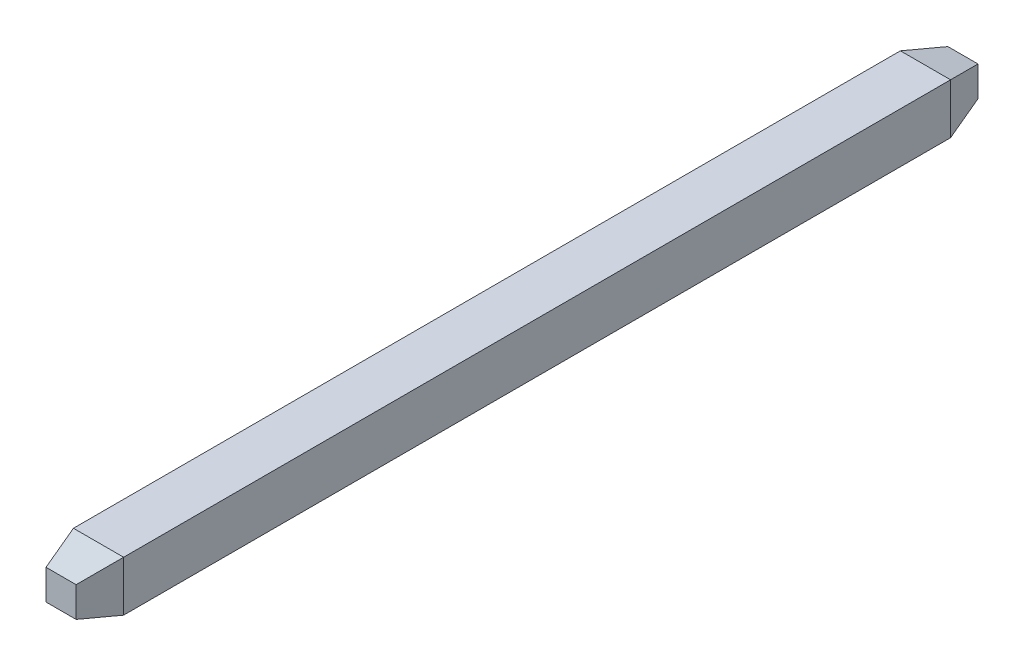
ISO-10303-21;
HEADER;
FILE_DESCRIPTION(('STEP AP214'),'2;1');
FILE_NAME('part.step','',(''),(''),'','','');
FILE_SCHEMA(('AUTOMOTIVE_DESIGN { 1 0 10303 214 1 1 1 1 }'));
ENDSEC;
DATA;
#1=APPLICATION_CONTEXT('core data for automotive mechanical design processes');
#2=APPLICATION_PROTOCOL_DEFINITION('international standard','automotive_design',2000,#1);
#3=PRODUCT_CONTEXT('',#1,'mechanical');
#4=PRODUCT('Part','Part','',(#3));
#5=PRODUCT_RELATED_PRODUCT_CATEGORY('part','',(#4));
#6=PRODUCT_DEFINITION_FORMATION('','',#4);
#7=PRODUCT_DEFINITION_CONTEXT('part definition',#1,'design');
#8=PRODUCT_DEFINITION('design','',#6,#7);
#9=PRODUCT_DEFINITION_SHAPE('','',#8);
#10=(LENGTH_UNIT() NAMED_UNIT(*) SI_UNIT(.MILLI.,.METRE.));
#11=(NAMED_UNIT(*) PLANE_ANGLE_UNIT() SI_UNIT($,.RADIAN.));
#12=(NAMED_UNIT(*) SI_UNIT($,.STERADIAN.) SOLID_ANGLE_UNIT());
#13=UNCERTAINTY_MEASURE_WITH_UNIT(LENGTH_MEASURE(1.E-05),#10,'distance_accuracy_value','');
#14=(GEOMETRIC_REPRESENTATION_CONTEXT(3) GLOBAL_UNCERTAINTY_ASSIGNED_CONTEXT((#13)) GLOBAL_UNIT_ASSIGNED_CONTEXT((#10,
#11,#12)) REPRESENTATION_CONTEXT('',''));
#15=CARTESIAN_POINT('',(0.,0.,0.));
#16=DIRECTION('',(0.,0.,1.));
#17=DIRECTION('',(1.,0.,0.));
#18=AXIS2_PLACEMENT_3D('',#15,#16,#17);
#19=CARTESIAN_POINT('',(2.86,-1.53140500673767,7.92229749663118));
#20=DIRECTION('',(0.965925826289069,0.,0.25881904510252));
#21=DIRECTION('',(0.25881904510252,0.,-0.965925826289069));
#22=AXIS2_PLACEMENT_3D('',#19,#20,#21);
#23=PLANE('',#22);
#24=DIRECTION('',(0.,1.,0.));
#25=VECTOR('',#24,1.);
#26=CARTESIAN_POINT('',(2.732,0.,8.4));
#27=LINE('',#26,#25);
#28=CARTESIAN_POINT('',(2.732,-0.192000000000036,8.4));
#29=VERTEX_POINT('',#28);
#30=CARTESIAN_POINT('',(2.732,0.191999999999964,8.4));
#31=VERTEX_POINT('',#30);
#32=EDGE_CURVE('E20',#29,#31,#27,.T.);
#33=ORIENTED_EDGE('',*,*,#32,.F.);
#34=DIRECTION('',(-0.25056280708573,0.250562807085731,0.93511312653103));
#35=VECTOR('',#34,1.);
#36=CARTESIAN_POINT('',(2.86,-0.320000000000036,7.92229749663118));
#37=LINE('',#36,#35);
#38=CARTESIAN_POINT('',(2.86,-0.320000000000036,7.92229749663118));
#39=VERTEX_POINT('',#38);
#40=EDGE_CURVE('E110',#39,#29,#37,.T.);
#41=ORIENTED_EDGE('',*,*,#40,.F.);
#42=DIRECTION('',(0.,1.,0.));
#43=VECTOR('',#42,1.);
#44=CARTESIAN_POINT('',(2.86,-0.320000000000036,7.92229749663118));
#45=LINE('',#44,#43);
#46=CARTESIAN_POINT('',(2.86,0.319999999999963,7.92229749663118));
#47=VERTEX_POINT('',#46);
#48=EDGE_CURVE('E96',#47,#39,#45,.F.);
#49=ORIENTED_EDGE('',*,*,#48,.F.);
#50=DIRECTION('',(0.25056280708573,0.250562807085731,-0.93511312653103));
#51=VECTOR('',#50,1.);
#52=CARTESIAN_POINT('',(2.732,0.191999999999963,8.4));
#53=LINE('',#52,#51);
#54=EDGE_CURVE('E94',#31,#47,#53,.T.);
#55=ORIENTED_EDGE('',*,*,#54,.F.);
#56=EDGE_LOOP('',(#33,#41,#49,#55));
#57=FACE_BOUND('',#56,.T.);
#58=ADVANCED_FACE('F17',(#57),#23,.T.);
#59=CARTESIAN_POINT('',(2.86,-1.53140500673767,-2.62229749663118));
#60=DIRECTION('',(-0.965925826289068,0.,0.258819045102521));
#61=DIRECTION('',(0.258819045102521,0.,0.965925826289068));
#62=AXIS2_PLACEMENT_3D('',#59,#60,#61);
#63=PLANE('',#62);
#64=DIRECTION('',(-0.25056280708573,0.250562807085732,-0.93511312653103));
#65=VECTOR('',#64,1.);
#66=CARTESIAN_POINT('',(2.86,-0.320000000000036,-2.62229749663118));
#67=LINE('',#66,#65);
#68=CARTESIAN_POINT('',(2.86,-0.320000000000036,-2.62229749663118));
#69=VERTEX_POINT('',#68);
#70=CARTESIAN_POINT('',(2.732,-0.192000000000036,-3.1));
#71=VERTEX_POINT('',#70);
#72=EDGE_CURVE('E113',#69,#71,#67,.T.);
#73=ORIENTED_EDGE('',*,*,#72,.T.);
#74=DIRECTION('',(0.,1.,0.));
#75=VECTOR('',#74,1.);
#76=CARTESIAN_POINT('',(2.732,0.,-3.1));
#77=LINE('',#76,#75);
#78=CARTESIAN_POINT('',(2.732,0.191999999999964,-3.1));
#79=VERTEX_POINT('',#78);
#80=EDGE_CURVE('E79',#71,#79,#77,.T.);
#81=ORIENTED_EDGE('',*,*,#80,.T.);
#82=DIRECTION('',(0.25056280708573,0.250562807085732,0.93511312653103));
#83=VECTOR('',#82,1.);
#84=CARTESIAN_POINT('',(2.732,0.191999999999962,-3.1));
#85=LINE('',#84,#83);
#86=CARTESIAN_POINT('',(2.86,0.319999999999963,-2.62229749663118));
#87=VERTEX_POINT('',#86);
#88=EDGE_CURVE('E108',#79,#87,#85,.T.);
#89=ORIENTED_EDGE('',*,*,#88,.T.);
#90=DIRECTION('',(0.,1.,0.));
#91=VECTOR('',#90,1.);
#92=CARTESIAN_POINT('',(2.86,-0.320000000000036,-2.62229749663118));
#93=LINE('',#92,#91);
#94=EDGE_CURVE('E118',#69,#87,#93,.T.);
#95=ORIENTED_EDGE('',*,*,#94,.F.);
#96=EDGE_LOOP('',(#73,#81,#89,#95));
#97=FACE_BOUND('',#96,.T.);
#98=ADVANCED_FACE('F281',(#97),#63,.F.);
#99=CARTESIAN_POINT('',(2.54,0.,8.4));
#100=DIRECTION('',(0.,0.,1.));
#101=DIRECTION('',(1.,0.,0.));
#102=AXIS2_PLACEMENT_3D('',#99,#100,#101);
#103=PLANE('',#102);
#104=DIRECTION('',(1.,0.,0.));
#105=VECTOR('',#104,1.);
#106=CARTESIAN_POINT('',(1.00859499326237,-0.192000000000036,8.4));
#107=LINE('',#106,#105);
#108=CARTESIAN_POINT('',(2.348,-0.192000000000036,8.4));
#109=VERTEX_POINT('',#108);
#110=EDGE_CURVE('E90',#29,#109,#107,.F.);
#111=ORIENTED_EDGE('',*,*,#110,.F.);
#112=ORIENTED_EDGE('',*,*,#32,.T.);
#113=DIRECTION('',(1.,0.,0.));
#114=VECTOR('',#113,1.);
#115=CARTESIAN_POINT('',(4.07140500673763,0.191999999999962,8.4));
#116=LINE('',#115,#114);
#117=CARTESIAN_POINT('',(2.348,0.191999999999963,8.4));
#118=VERTEX_POINT('',#117);
#119=EDGE_CURVE('E88',#118,#31,#116,.T.);
#120=ORIENTED_EDGE('',*,*,#119,.F.);
#121=DIRECTION('',(0.,1.,0.));
#122=VECTOR('',#121,1.);
#123=CARTESIAN_POINT('',(2.348,1.53140500673759,8.4));
#124=LINE('',#123,#122);
#125=EDGE_CURVE('E124',#109,#118,#124,.T.);
#126=ORIENTED_EDGE('',*,*,#125,.F.);
#127=EDGE_LOOP('',(#111,#112,#120,#126));
#128=FACE_BOUND('',#127,.T.);
#129=ADVANCED_FACE('F85',(#128),#103,.T.);
#130=CARTESIAN_POINT('',(4.07140500673763,0.319999999999963,7.92229749663118));
#131=DIRECTION('',(0.,0.965925826289069,0.25881904510252));
#132=DIRECTION('',(0.,-0.25881904510252,0.965925826289069));
#133=AXIS2_PLACEMENT_3D('',#130,#131,#132);
#134=PLANE('',#133);
#135=ORIENTED_EDGE('',*,*,#119,.T.);
#136=ORIENTED_EDGE('',*,*,#54,.T.);
#137=DIRECTION('',(-1.,0.,0.));
#138=VECTOR('',#137,1.);
#139=CARTESIAN_POINT('',(2.86,0.319999999999963,7.92229749663118));
#140=LINE('',#139,#138);
#141=CARTESIAN_POINT('',(2.22,0.319999999999963,7.92229749663118));
#142=VERTEX_POINT('',#141);
#143=EDGE_CURVE('E127',#142,#47,#140,.F.);
#144=ORIENTED_EDGE('',*,*,#143,.F.);
#145=DIRECTION('',(-0.250562807085731,0.250562807085729,-0.93511312653103));
#146=VECTOR('',#145,1.);
#147=CARTESIAN_POINT('',(2.348,0.191999999999963,8.4));
#148=LINE('',#147,#146);
#149=EDGE_CURVE('E102',#118,#142,#148,.T.);
#150=ORIENTED_EDGE('',*,*,#149,.F.);
#151=EDGE_LOOP('',(#135,#136,#144,#150));
#152=FACE_BOUND('',#151,.T.);
#153=ADVANCED_FACE('F100',(#152),#134,.T.);
#154=CARTESIAN_POINT('',(2.54,0.,-3.1));
#155=DIRECTION('',(0.,0.,1.));
#156=DIRECTION('',(1.,0.,0.));
#157=AXIS2_PLACEMENT_3D('',#154,#155,#156);
#158=PLANE('',#157);
#159=ORIENTED_EDGE('',*,*,#80,.F.);
#160=DIRECTION('',(1.,0.,0.));
#161=VECTOR('',#160,1.);
#162=CARTESIAN_POINT('',(1.00859499326237,-0.192000000000036,-3.1));
#163=LINE('',#162,#161);
#164=CARTESIAN_POINT('',(2.348,-0.192000000000036,-3.1));
#165=VERTEX_POINT('',#164);
#166=EDGE_CURVE('E115',#71,#165,#163,.F.);
#167=ORIENTED_EDGE('',*,*,#166,.T.);
#168=DIRECTION('',(0.,1.,0.));
#169=VECTOR('',#168,1.);
#170=CARTESIAN_POINT('',(2.348,1.53140500673759,-3.1));
#171=LINE('',#170,#169);
#172=CARTESIAN_POINT('',(2.348,0.191999999999963,-3.1));
#173=VERTEX_POINT('',#172);
#174=EDGE_CURVE('E138',#165,#173,#171,.T.);
#175=ORIENTED_EDGE('',*,*,#174,.T.);
#176=DIRECTION('',(1.,0.,0.));
#177=VECTOR('',#176,1.);
#178=CARTESIAN_POINT('',(4.07140500673763,0.191999999999962,-3.1));
#179=LINE('',#178,#177);
#180=EDGE_CURVE('E106',#173,#79,#179,.T.);
#181=ORIENTED_EDGE('',*,*,#180,.T.);
#182=EDGE_LOOP('',(#159,#167,#175,#181));
#183=FACE_BOUND('',#182,.T.);
#184=ADVANCED_FACE('F257',(#183),#158,.F.);
#185=CARTESIAN_POINT('',(4.07140500673763,0.319999999999963,-2.62229749663118));
#186=DIRECTION('',(0.,-0.965925826289068,0.258819045102521));
#187=DIRECTION('',(0.,-0.258819045102521,-0.965925826289068));
#188=AXIS2_PLACEMENT_3D('',#185,#186,#187);
#189=PLANE('',#188);
#190=ORIENTED_EDGE('',*,*,#88,.F.);
#191=ORIENTED_EDGE('',*,*,#180,.F.);
#192=DIRECTION('',(-0.250562807085732,0.250562807085731,0.935113126531029));
#193=VECTOR('',#192,1.);
#194=CARTESIAN_POINT('',(2.348,0.191999999999963,-3.1));
#195=LINE('',#194,#193);
#196=CARTESIAN_POINT('',(2.22,0.319999999999963,-2.62229749663118));
#197=VERTEX_POINT('',#196);
#198=EDGE_CURVE('E140',#173,#197,#195,.T.);
#199=ORIENTED_EDGE('',*,*,#198,.T.);
#200=DIRECTION('',(-1.,0.,0.));
#201=VECTOR('',#200,1.);
#202=CARTESIAN_POINT('',(2.86,0.319999999999963,-2.62229749663118));
#203=LINE('',#202,#201);
#204=EDGE_CURVE('E133',#87,#197,#203,.T.);
#205=ORIENTED_EDGE('',*,*,#204,.F.);
#206=EDGE_LOOP('',(#190,#191,#199,#205));
#207=FACE_BOUND('',#206,.T.);
#208=ADVANCED_FACE('F249',(#207),#189,.F.);
#209=CARTESIAN_POINT('',(1.00859499326237,-0.320000000000037,7.92229749663118));
#210=DIRECTION('',(0.,-0.965925826289069,0.25881904510252));
#211=DIRECTION('',(0.,-0.25881904510252,-0.965925826289069));
#212=AXIS2_PLACEMENT_3D('',#209,#210,#211);
#213=PLANE('',#212);
#214=ORIENTED_EDGE('',*,*,#110,.T.);
#215=DIRECTION('',(0.250562807085731,0.25056280708573,0.93511312653103));
#216=VECTOR('',#215,1.);
#217=CARTESIAN_POINT('',(2.22,-0.320000000000037,7.92229749663118));
#218=LINE('',#217,#216);
#219=CARTESIAN_POINT('',(2.22,-0.320000000000037,7.92229749663118));
#220=VERTEX_POINT('',#219);
#221=EDGE_CURVE('E121',#220,#109,#218,.T.);
#222=ORIENTED_EDGE('',*,*,#221,.F.);
#223=DIRECTION('',(1.,0.,0.));
#224=VECTOR('',#223,1.);
#225=CARTESIAN_POINT('',(2.22,-0.320000000000037,7.92229749663118));
#226=LINE('',#225,#224);
#227=EDGE_CURVE('E142',#39,#220,#226,.F.);
#228=ORIENTED_EDGE('',*,*,#227,.F.);
#229=ORIENTED_EDGE('',*,*,#40,.T.);
#230=EDGE_LOOP('',(#214,#222,#228,#229));
#231=FACE_BOUND('',#230,.T.);
#232=ADVANCED_FACE('F171',(#231),#213,.T.);
#233=CARTESIAN_POINT('',(1.00859499326237,-0.320000000000037,-2.62229749663118));
#234=DIRECTION('',(0.,0.965925826289068,0.258819045102521));
#235=DIRECTION('',(0.,-0.258819045102521,0.965925826289068));
#236=AXIS2_PLACEMENT_3D('',#233,#234,#235);
#237=PLANE('',#236);
#238=DIRECTION('',(0.250562807085732,0.25056280708573,-0.93511312653103));
#239=VECTOR('',#238,1.);
#240=CARTESIAN_POINT('',(2.22,-0.320000000000037,-2.62229749663118));
#241=LINE('',#240,#239);
#242=CARTESIAN_POINT('',(2.22,-0.320000000000037,-2.62229749663118));
#243=VERTEX_POINT('',#242);
#244=EDGE_CURVE('E136',#243,#165,#241,.T.);
#245=ORIENTED_EDGE('',*,*,#244,.T.);
#246=ORIENTED_EDGE('',*,*,#166,.F.);
#247=ORIENTED_EDGE('',*,*,#72,.F.);
#248=DIRECTION('',(1.,0.,0.));
#249=VECTOR('',#248,1.);
#250=CARTESIAN_POINT('',(2.22,-0.320000000000037,-2.62229749663118));
#251=LINE('',#250,#249);
#252=EDGE_CURVE('E35',#243,#69,#251,.T.);
#253=ORIENTED_EDGE('',*,*,#252,.F.);
#254=EDGE_LOOP('',(#245,#246,#247,#253));
#255=FACE_BOUND('',#254,.T.);
#256=ADVANCED_FACE('F188',(#255),#237,.F.);
#257=CARTESIAN_POINT('',(2.86,-0.320000000000036,-3.1));
#258=DIRECTION('',(1.,0.,0.));
#259=DIRECTION('',(0.,1.,0.));
#260=AXIS2_PLACEMENT_3D('',#257,#258,#259);
#261=PLANE('',#260);
#262=ORIENTED_EDGE('',*,*,#94,.T.);
#263=DIRECTION('',(0.,0.,1.));
#264=VECTOR('',#263,1.);
#265=CARTESIAN_POINT('',(2.86,0.319999999999963,-3.1));
#266=LINE('',#265,#264);
#267=EDGE_CURVE('E130',#47,#87,#266,.F.);
#268=ORIENTED_EDGE('',*,*,#267,.F.);
#269=ORIENTED_EDGE('',*,*,#48,.T.);
#270=DIRECTION('',(0.,0.,1.));
#271=VECTOR('',#270,1.);
#272=CARTESIAN_POINT('',(2.86,-0.320000000000037,-3.1));
#273=LINE('',#272,#271);
#274=EDGE_CURVE('E146',#69,#39,#273,.T.);
#275=ORIENTED_EDGE('',*,*,#274,.F.);
#276=EDGE_LOOP('',(#262,#268,#269,#275));
#277=FACE_BOUND('',#276,.T.);
#278=ADVANCED_FACE('F174',(#277),#261,.T.);
#279=CARTESIAN_POINT('',(2.22,1.53140500673759,7.92229749663118));
#280=DIRECTION('',(-0.965925826289069,0.,0.25881904510252));
#281=DIRECTION('',(0.25881904510252,0.,0.965925826289069));
#282=AXIS2_PLACEMENT_3D('',#279,#280,#281);
#283=PLANE('',#282);
#284=ORIENTED_EDGE('',*,*,#125,.T.);
#285=ORIENTED_EDGE('',*,*,#149,.T.);
#286=DIRECTION('',(0.,-1.,0.));
#287=VECTOR('',#286,1.);
#288=CARTESIAN_POINT('',(2.22,0.319999999999964,7.92229749663118));
#289=LINE('',#288,#287);
#290=EDGE_CURVE('E149',#220,#142,#289,.F.);
#291=ORIENTED_EDGE('',*,*,#290,.F.);
#292=ORIENTED_EDGE('',*,*,#221,.T.);
#293=EDGE_LOOP('',(#284,#285,#291,#292));
#294=FACE_BOUND('',#293,.T.);
#295=ADVANCED_FACE('F179',(#294),#283,.T.);
#296=CARTESIAN_POINT('',(2.86,0.319999999999963,-3.1));
#297=DIRECTION('',(0.,1.,0.));
#298=DIRECTION('',(-1.,0.,0.));
#299=AXIS2_PLACEMENT_3D('',#296,#297,#298);
#300=PLANE('',#299);
#301=ORIENTED_EDGE('',*,*,#204,.T.);
#302=DIRECTION('',(0.,0.,1.));
#303=VECTOR('',#302,1.);
#304=CARTESIAN_POINT('',(2.22,0.319999999999963,-3.1));
#305=LINE('',#304,#303);
#306=EDGE_CURVE('E152',#142,#197,#305,.F.);
#307=ORIENTED_EDGE('',*,*,#306,.F.);
#308=ORIENTED_EDGE('',*,*,#143,.T.);
#309=ORIENTED_EDGE('',*,*,#267,.T.);
#310=EDGE_LOOP('',(#301,#307,#308,#309));
#311=FACE_BOUND('',#310,.T.);
#312=ADVANCED_FACE('F177',(#311),#300,.T.);
#313=CARTESIAN_POINT('',(2.22,1.53140500673759,-2.62229749663118));
#314=DIRECTION('',(0.965925826289068,0.,0.258819045102521));
#315=DIRECTION('',(0.258819045102521,0.,-0.965925826289068));
#316=AXIS2_PLACEMENT_3D('',#313,#314,#315);
#317=PLANE('',#316);
#318=ORIENTED_EDGE('',*,*,#198,.F.);
#319=ORIENTED_EDGE('',*,*,#174,.F.);
#320=ORIENTED_EDGE('',*,*,#244,.F.);
#321=DIRECTION('',(0.,-1.,0.));
#322=VECTOR('',#321,1.);
#323=CARTESIAN_POINT('',(2.22,0.319999999999964,-2.62229749663118));
#324=LINE('',#323,#322);
#325=EDGE_CURVE('E26',#197,#243,#324,.T.);
#326=ORIENTED_EDGE('',*,*,#325,.F.);
#327=EDGE_LOOP('',(#318,#319,#320,#326));
#328=FACE_BOUND('',#327,.T.);
#329=ADVANCED_FACE('F163',(#328),#317,.F.);
#330=CARTESIAN_POINT('',(2.22,-0.320000000000037,-3.1));
#331=DIRECTION('',(0.,-1.,0.));
#332=DIRECTION('',(1.,0.,0.));
#333=AXIS2_PLACEMENT_3D('',#330,#331,#332);
#334=PLANE('',#333);
#335=ORIENTED_EDGE('',*,*,#252,.T.);
#336=ORIENTED_EDGE('',*,*,#274,.T.);
#337=ORIENTED_EDGE('',*,*,#227,.T.);
#338=DIRECTION('',(0.,0.,1.));
#339=VECTOR('',#338,1.);
#340=CARTESIAN_POINT('',(2.22,-0.320000000000037,-3.1));
#341=LINE('',#340,#339);
#342=EDGE_CURVE('E11',#243,#220,#341,.T.);
#343=ORIENTED_EDGE('',*,*,#342,.F.);
#344=EDGE_LOOP('',(#335,#336,#337,#343));
#345=FACE_BOUND('',#344,.T.);
#346=ADVANCED_FACE('F167',(#345),#334,.T.);
#347=CARTESIAN_POINT('',(2.22,0.319999999999964,-3.1));
#348=DIRECTION('',(-1.,0.,0.));
#349=DIRECTION('',(0.,-1.,0.));
#350=AXIS2_PLACEMENT_3D('',#347,#348,#349);
#351=PLANE('',#350);
#352=ORIENTED_EDGE('',*,*,#325,.T.);
#353=ORIENTED_EDGE('',*,*,#342,.T.);
#354=ORIENTED_EDGE('',*,*,#290,.T.);
#355=ORIENTED_EDGE('',*,*,#306,.T.);
#356=EDGE_LOOP('',(#352,#353,#354,#355));
#357=FACE_BOUND('',#356,.T.);
#358=ADVANCED_FACE('F158',(#357),#351,.T.);
#359=CLOSED_SHELL('',(#58,#98,#129,#153,#184,#208,#232,#256,#278,#295,#312,#329,#346,#358));
#360=MANIFOLD_SOLID_BREP('B1',#359);
#361=ADVANCED_BREP_SHAPE_REPRESENTATION('',(#18,#360),#14);
#362=SHAPE_DEFINITION_REPRESENTATION(#9,#361);
ENDSEC;
END-ISO-10303-21;
